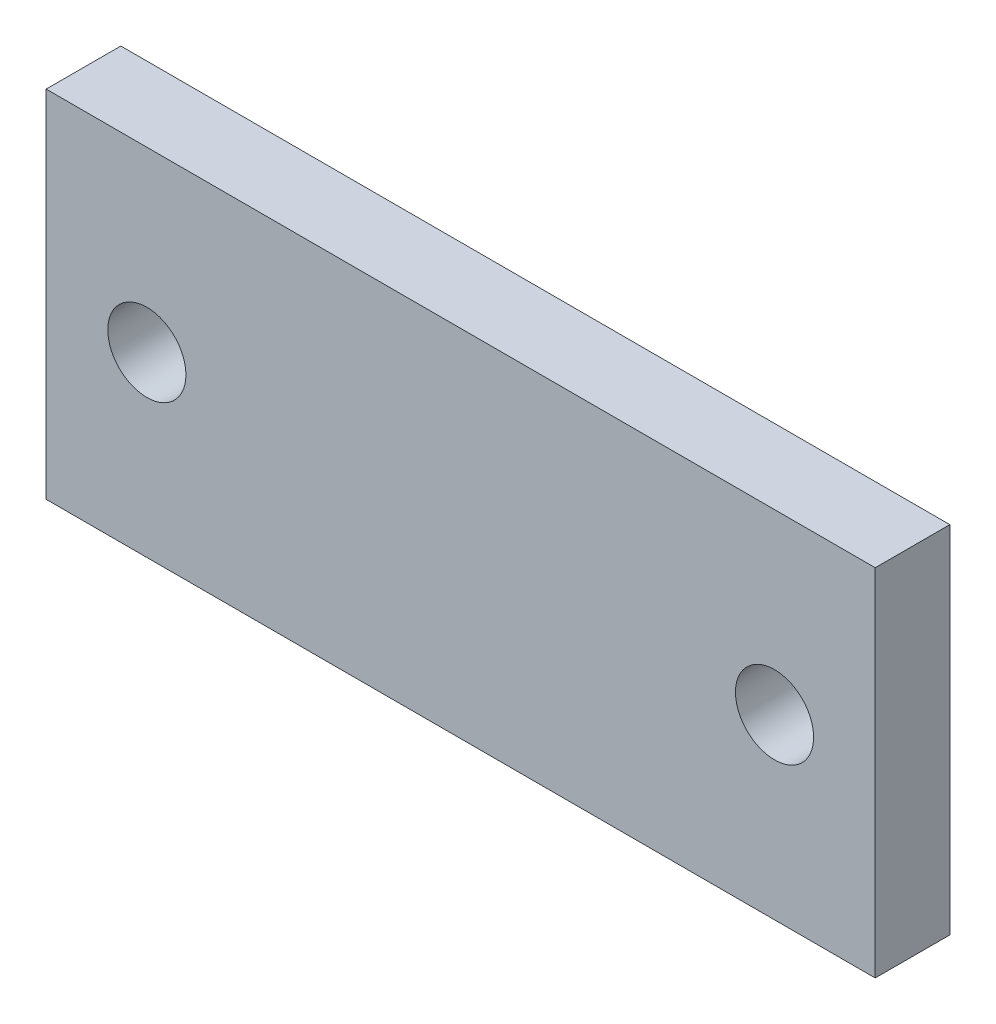
ISO-10303-21;
HEADER;
FILE_DESCRIPTION(('STEP AP214'),'2;1');
FILE_NAME('part.step','',(''),(''),'','','');
FILE_SCHEMA(('AUTOMOTIVE_DESIGN { 1 0 10303 214 1 1 1 1 }'));
ENDSEC;
DATA;
#1=APPLICATION_CONTEXT('core data for automotive mechanical design processes');
#2=APPLICATION_PROTOCOL_DEFINITION('international standard','automotive_design',2000,#1);
#3=PRODUCT_CONTEXT('',#1,'mechanical');
#4=PRODUCT('Part','Part','',(#3));
#5=PRODUCT_RELATED_PRODUCT_CATEGORY('part','',(#4));
#6=PRODUCT_DEFINITION_FORMATION('','',#4);
#7=PRODUCT_DEFINITION_CONTEXT('part definition',#1,'design');
#8=PRODUCT_DEFINITION('design','',#6,#7);
#9=PRODUCT_DEFINITION_SHAPE('','',#8);
#10=(LENGTH_UNIT() NAMED_UNIT(*) SI_UNIT(.MILLI.,.METRE.));
#11=(NAMED_UNIT(*) PLANE_ANGLE_UNIT() SI_UNIT($,.RADIAN.));
#12=(NAMED_UNIT(*) SI_UNIT($,.STERADIAN.) SOLID_ANGLE_UNIT());
#13=UNCERTAINTY_MEASURE_WITH_UNIT(LENGTH_MEASURE(1.E-05),#10,'distance_accuracy_value','');
#14=(GEOMETRIC_REPRESENTATION_CONTEXT(3) GLOBAL_UNCERTAINTY_ASSIGNED_CONTEXT((#13)) GLOBAL_UNIT_ASSIGNED_CONTEXT((#10,
#11,#12)) REPRESENTATION_CONTEXT('',''));
#15=CARTESIAN_POINT('',(0.,0.,0.));
#16=DIRECTION('',(0.,0.,1.));
#17=DIRECTION('',(1.,0.,0.));
#18=AXIS2_PLACEMENT_3D('',#15,#16,#17);
#19=CARTESIAN_POINT('',(0.,0.,6.3));
#20=DIRECTION('',(0.,0.,1.));
#21=DIRECTION('',(1.,0.,0.));
#22=AXIS2_PLACEMENT_3D('',#19,#20,#21);
#23=PLANE('',#22);
#24=CARTESIAN_POINT('',(-26.5,0.,6.3));
#25=DIRECTION('',(0.,0.,1.));
#26=DIRECTION('',(1.,0.,0.));
#27=AXIS2_PLACEMENT_3D('',#24,#25,#26);
#28=CIRCLE('',#27,3.3);
#29=CARTESIAN_POINT('',(-23.2,0.,6.3));
#30=VERTEX_POINT('',#29);
#31=EDGE_CURVE('E102',#30,#30,#28,.T.);
#32=ORIENTED_EDGE('',*,*,#31,.F.);
#33=EDGE_LOOP('',(#32));
#34=FACE_BOUND('',#33,.T.);
#35=DIRECTION('',(0.,-1.,0.));
#36=VECTOR('',#35,1.);
#37=CARTESIAN_POINT('',(-35.,-15.,6.3));
#38=LINE('',#37,#36);
#39=CARTESIAN_POINT('',(-35.,15.,6.3));
#40=VERTEX_POINT('',#39);
#41=CARTESIAN_POINT('',(-35.,-15.,6.3));
#42=VERTEX_POINT('',#41);
#43=EDGE_CURVE('E87',#40,#42,#38,.T.);
#44=ORIENTED_EDGE('',*,*,#43,.T.);
#45=DIRECTION('',(1.,0.,0.));
#46=VECTOR('',#45,1.);
#47=CARTESIAN_POINT('',(35.,-15.,6.3));
#48=LINE('',#47,#46);
#49=CARTESIAN_POINT('',(35.,-15.,6.3));
#50=VERTEX_POINT('',#49);
#51=EDGE_CURVE('E82',#42,#50,#48,.T.);
#52=ORIENTED_EDGE('',*,*,#51,.T.);
#53=DIRECTION('',(0.,1.,0.));
#54=VECTOR('',#53,1.);
#55=CARTESIAN_POINT('',(35.,-15.,6.3));
#56=LINE('',#55,#54);
#57=CARTESIAN_POINT('',(35.,15.,6.3));
#58=VERTEX_POINT('',#57);
#59=EDGE_CURVE('E85',#50,#58,#56,.T.);
#60=ORIENTED_EDGE('',*,*,#59,.T.);
#61=DIRECTION('',(-1.,0.,0.));
#62=VECTOR('',#61,1.);
#63=CARTESIAN_POINT('',(35.,15.,6.3));
#64=LINE('',#63,#62);
#65=EDGE_CURVE('E52',#58,#40,#64,.T.);
#66=ORIENTED_EDGE('',*,*,#65,.T.);
#67=EDGE_LOOP('',(#44,#52,#60,#66));
#68=FACE_BOUND('',#67,.T.);
#69=CARTESIAN_POINT('',(26.5,0.,6.3));
#70=DIRECTION('',(0.,0.,1.));
#71=DIRECTION('',(-1.,0.,0.));
#72=AXIS2_PLACEMENT_3D('',#69,#70,#71);
#73=CIRCLE('',#72,3.3);
#74=CARTESIAN_POINT('',(23.2,0.,6.3));
#75=VERTEX_POINT('',#74);
#76=EDGE_CURVE('E117',#75,#75,#73,.T.);
#77=ORIENTED_EDGE('',*,*,#76,.F.);
#78=EDGE_LOOP('',(#77));
#79=FACE_BOUND('',#78,.T.);
#80=ADVANCED_FACE('F35',(#34,#68,#79),#23,.T.);
#81=CARTESIAN_POINT('',(0.,0.,0.));
#82=DIRECTION('',(0.,0.,1.));
#83=DIRECTION('',(1.,0.,0.));
#84=AXIS2_PLACEMENT_3D('',#81,#82,#83);
#85=PLANE('',#84);
#86=CARTESIAN_POINT('',(-26.5,0.,0.));
#87=DIRECTION('',(0.,0.,1.));
#88=DIRECTION('',(1.,0.,0.));
#89=AXIS2_PLACEMENT_3D('',#86,#87,#88);
#90=CIRCLE('',#89,3.3);
#91=CARTESIAN_POINT('',(-23.2,0.,0.));
#92=VERTEX_POINT('',#91);
#93=EDGE_CURVE('E114',#92,#92,#90,.T.);
#94=ORIENTED_EDGE('',*,*,#93,.T.);
#95=EDGE_LOOP('',(#94));
#96=FACE_BOUND('',#95,.T.);
#97=DIRECTION('',(0.,-1.,0.));
#98=VECTOR('',#97,1.);
#99=CARTESIAN_POINT('',(-35.,-15.,0.));
#100=LINE('',#99,#98);
#101=CARTESIAN_POINT('',(-35.,15.,0.));
#102=VERTEX_POINT('',#101);
#103=CARTESIAN_POINT('',(-35.,-15.,0.));
#104=VERTEX_POINT('',#103);
#105=EDGE_CURVE('E99',#102,#104,#100,.T.);
#106=ORIENTED_EDGE('',*,*,#105,.F.);
#107=DIRECTION('',(-1.,0.,0.));
#108=VECTOR('',#107,1.);
#109=CARTESIAN_POINT('',(35.,15.,0.));
#110=LINE('',#109,#108);
#111=CARTESIAN_POINT('',(35.,15.,0.));
#112=VERTEX_POINT('',#111);
#113=EDGE_CURVE('E75',#112,#102,#110,.T.);
#114=ORIENTED_EDGE('',*,*,#113,.F.);
#115=DIRECTION('',(0.,1.,0.));
#116=VECTOR('',#115,1.);
#117=CARTESIAN_POINT('',(35.,-15.,0.));
#118=LINE('',#117,#116);
#119=CARTESIAN_POINT('',(35.,-15.,0.));
#120=VERTEX_POINT('',#119);
#121=EDGE_CURVE('E69',#120,#112,#118,.T.);
#122=ORIENTED_EDGE('',*,*,#121,.F.);
#123=DIRECTION('',(1.,0.,0.));
#124=VECTOR('',#123,1.);
#125=CARTESIAN_POINT('',(35.,-15.,0.));
#126=LINE('',#125,#124);
#127=EDGE_CURVE('E91',#104,#120,#126,.T.);
#128=ORIENTED_EDGE('',*,*,#127,.F.);
#129=EDGE_LOOP('',(#106,#114,#122,#128));
#130=FACE_BOUND('',#129,.T.);
#131=CARTESIAN_POINT('',(26.5,0.,0.));
#132=DIRECTION('',(0.,0.,1.));
#133=DIRECTION('',(-1.,0.,0.));
#134=AXIS2_PLACEMENT_3D('',#131,#132,#133);
#135=CIRCLE('',#134,3.3);
#136=CARTESIAN_POINT('',(23.2,0.,0.));
#137=VERTEX_POINT('',#136);
#138=EDGE_CURVE('E120',#137,#137,#135,.T.);
#139=ORIENTED_EDGE('',*,*,#138,.T.);
#140=EDGE_LOOP('',(#139));
#141=FACE_BOUND('',#140,.T.);
#142=ADVANCED_FACE('F110',(#96,#130,#141),#85,.F.);
#143=CARTESIAN_POINT('',(-35.,-15.,6.3));
#144=DIRECTION('',(1.,0.,0.));
#145=DIRECTION('',(0.,1.,0.));
#146=AXIS2_PLACEMENT_3D('',#143,#144,#145);
#147=PLANE('',#146);
#148=ORIENTED_EDGE('',*,*,#105,.T.);
#149=DIRECTION('',(0.,0.,-1.));
#150=VECTOR('',#149,1.);
#151=CARTESIAN_POINT('',(-35.,-15.,6.3));
#152=LINE('',#151,#150);
#153=EDGE_CURVE('E11',#42,#104,#152,.T.);
#154=ORIENTED_EDGE('',*,*,#153,.F.);
#155=ORIENTED_EDGE('',*,*,#43,.F.);
#156=DIRECTION('',(0.,0.,-1.));
#157=VECTOR('',#156,1.);
#158=CARTESIAN_POINT('',(-35.,15.,6.3));
#159=LINE('',#158,#157);
#160=EDGE_CURVE('E95',#40,#102,#159,.T.);
#161=ORIENTED_EDGE('',*,*,#160,.T.);
#162=EDGE_LOOP('',(#148,#154,#155,#161));
#163=FACE_BOUND('',#162,.T.);
#164=ADVANCED_FACE('F37',(#163),#147,.F.);
#165=CARTESIAN_POINT('',(35.,-15.,6.3));
#166=DIRECTION('',(0.,1.,0.));
#167=DIRECTION('',(-1.,0.,0.));
#168=AXIS2_PLACEMENT_3D('',#165,#166,#167);
#169=PLANE('',#168);
#170=ORIENTED_EDGE('',*,*,#127,.T.);
#171=DIRECTION('',(0.,0.,-1.));
#172=VECTOR('',#171,1.);
#173=CARTESIAN_POINT('',(35.,-15.,6.3));
#174=LINE('',#173,#172);
#175=EDGE_CURVE('E44',#50,#120,#174,.T.);
#176=ORIENTED_EDGE('',*,*,#175,.F.);
#177=ORIENTED_EDGE('',*,*,#51,.F.);
#178=ORIENTED_EDGE('',*,*,#153,.T.);
#179=EDGE_LOOP('',(#170,#176,#177,#178));
#180=FACE_BOUND('',#179,.T.);
#181=ADVANCED_FACE('F90',(#180),#169,.F.);
#182=CARTESIAN_POINT('',(35.,-15.,6.3));
#183=DIRECTION('',(-1.,0.,0.));
#184=DIRECTION('',(0.,-1.,0.));
#185=AXIS2_PLACEMENT_3D('',#182,#183,#184);
#186=PLANE('',#185);
#187=ORIENTED_EDGE('',*,*,#121,.T.);
#188=DIRECTION('',(0.,0.,-1.));
#189=VECTOR('',#188,1.);
#190=CARTESIAN_POINT('',(35.,15.,6.3));
#191=LINE('',#190,#189);
#192=EDGE_CURVE('E92',#58,#112,#191,.T.);
#193=ORIENTED_EDGE('',*,*,#192,.F.);
#194=ORIENTED_EDGE('',*,*,#59,.F.);
#195=ORIENTED_EDGE('',*,*,#175,.T.);
#196=EDGE_LOOP('',(#187,#193,#194,#195));
#197=FACE_BOUND('',#196,.T.);
#198=ADVANCED_FACE('F93',(#197),#186,.F.);
#199=CARTESIAN_POINT('',(35.,15.,6.3));
#200=DIRECTION('',(0.,-1.,0.));
#201=DIRECTION('',(1.,0.,0.));
#202=AXIS2_PLACEMENT_3D('',#199,#200,#201);
#203=PLANE('',#202);
#204=ORIENTED_EDGE('',*,*,#113,.T.);
#205=ORIENTED_EDGE('',*,*,#160,.F.);
#206=ORIENTED_EDGE('',*,*,#65,.F.);
#207=ORIENTED_EDGE('',*,*,#192,.T.);
#208=EDGE_LOOP('',(#204,#205,#206,#207));
#209=FACE_BOUND('',#208,.T.);
#210=ADVANCED_FACE('F107',(#209),#203,.F.);
#211=CARTESIAN_POINT('',(-26.5,0.,6.3));
#212=DIRECTION('',(0.,0.,-1.));
#213=DIRECTION('',(-1.,0.,0.));
#214=AXIS2_PLACEMENT_3D('',#211,#212,#213);
#215=CYLINDRICAL_SURFACE('',#214,3.3);
#216=ORIENTED_EDGE('',*,*,#31,.T.);
#217=EDGE_LOOP('',(#216));
#218=FACE_BOUND('',#217,.T.);
#219=ORIENTED_EDGE('',*,*,#93,.F.);
#220=EDGE_LOOP('',(#219));
#221=FACE_BOUND('',#220,.T.);
#222=ADVANCED_FACE('F138',(#218,#221),#215,.F.);
#223=CARTESIAN_POINT('',(26.5,0.,6.3));
#224=DIRECTION('',(0.,0.,-1.));
#225=DIRECTION('',(-1.,0.,0.));
#226=AXIS2_PLACEMENT_3D('',#223,#224,#225);
#227=CYLINDRICAL_SURFACE('',#226,3.3);
#228=ORIENTED_EDGE('',*,*,#76,.T.);
#229=EDGE_LOOP('',(#228));
#230=FACE_BOUND('',#229,.T.);
#231=ORIENTED_EDGE('',*,*,#138,.F.);
#232=EDGE_LOOP('',(#231));
#233=FACE_BOUND('',#232,.T.);
#234=ADVANCED_FACE('F126',(#230,#233),#227,.F.);
#235=CLOSED_SHELL('',(#80,#142,#164,#181,#198,#210,#222,#234));
#236=MANIFOLD_SOLID_BREP('B2',#235);
#237=ADVANCED_BREP_SHAPE_REPRESENTATION('',(#18,#236),#14);
#238=SHAPE_DEFINITION_REPRESENTATION(#9,#237);
ENDSEC;
END-ISO-10303-21;
